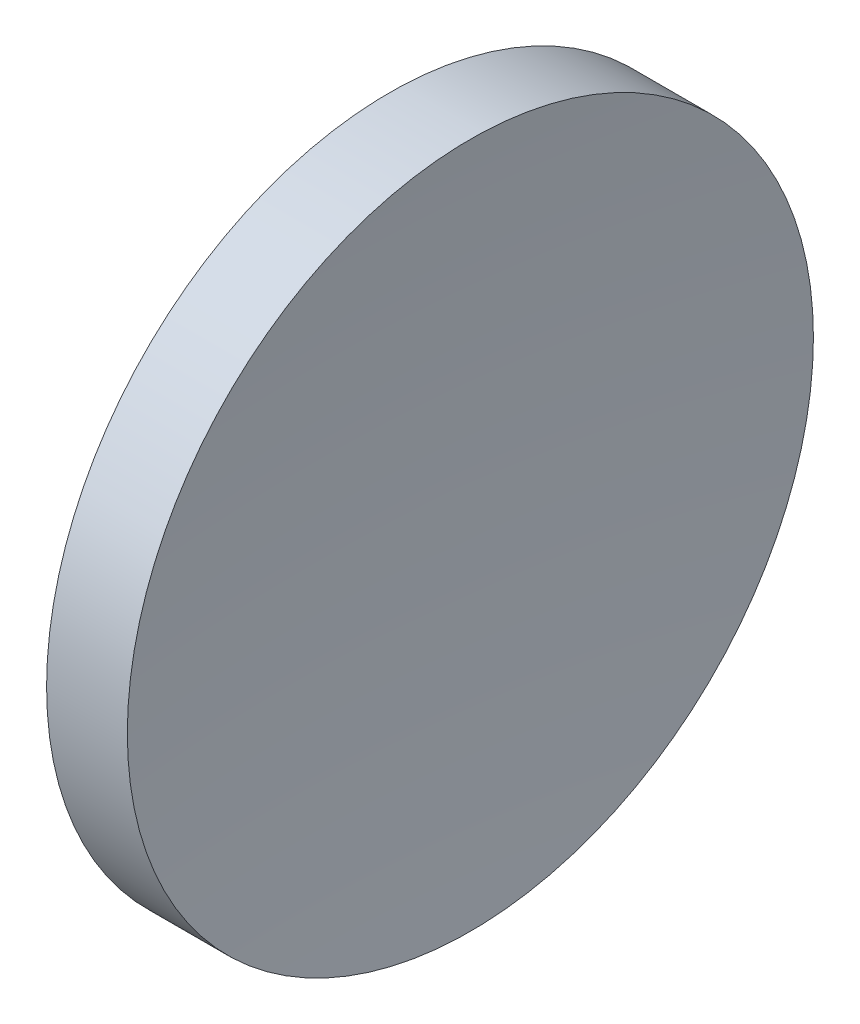
ISO-10303-21;
HEADER;
FILE_DESCRIPTION(('STEP AP214'),'2;1');
FILE_NAME('part.step','',(''),(''),'','','');
FILE_SCHEMA(('AUTOMOTIVE_DESIGN { 1 0 10303 214 1 1 1 1 }'));
ENDSEC;
DATA;
#1=APPLICATION_CONTEXT('core data for automotive mechanical design processes');
#2=APPLICATION_PROTOCOL_DEFINITION('international standard','automotive_design',2000,#1);
#3=PRODUCT_CONTEXT('',#1,'mechanical');
#4=PRODUCT('Part','Part','',(#3));
#5=PRODUCT_RELATED_PRODUCT_CATEGORY('part','',(#4));
#6=PRODUCT_DEFINITION_FORMATION('','',#4);
#7=PRODUCT_DEFINITION_CONTEXT('part definition',#1,'design');
#8=PRODUCT_DEFINITION('design','',#6,#7);
#9=PRODUCT_DEFINITION_SHAPE('','',#8);
#10=(LENGTH_UNIT() NAMED_UNIT(*) SI_UNIT(.MILLI.,.METRE.));
#11=(NAMED_UNIT(*) PLANE_ANGLE_UNIT() SI_UNIT($,.RADIAN.));
#12=(NAMED_UNIT(*) SI_UNIT($,.STERADIAN.) SOLID_ANGLE_UNIT());
#13=UNCERTAINTY_MEASURE_WITH_UNIT(LENGTH_MEASURE(1.E-05),#10,'distance_accuracy_value','');
#14=(GEOMETRIC_REPRESENTATION_CONTEXT(3) GLOBAL_UNCERTAINTY_ASSIGNED_CONTEXT((#13)) GLOBAL_UNIT_ASSIGNED_CONTEXT((#10,
#11,#12)) REPRESENTATION_CONTEXT('',''));
#15=CARTESIAN_POINT('',(0.,0.,0.));
#16=DIRECTION('',(0.,0.,1.));
#17=DIRECTION('',(1.,0.,0.));
#18=AXIS2_PLACEMENT_3D('',#15,#16,#17);
#19=CARTESIAN_POINT('',(128.439134688105,26.089041149195,0.0545449732430418));
#20=DIRECTION('',(0.,-1.,0.));
#21=DIRECTION('',(0.,0.,1.));
#22=AXIS2_PLACEMENT_3D('',#19,#20,#21);
#23=CIRCLE('',#22,82.62);
#24=TRIMMED_CURVE('',#23,(PARAMETER_VALUE(-1.57145651775599)),
(PARAMETER_VALUE(1.57145651775599)),.T.,.PARAMETER.);
#25=CARTESIAN_POINT('',(128.439134688105,26.089041149195,0.));
#26=DIRECTION('',(-1.,0.,0.));
#27=AXIS1_PLACEMENT('',#25,#26);
#28=SURFACE_OF_REVOLUTION('',#24,#27);
#29=CARTESIAN_POINT('',(46.2020740377033,26.089041149195,0.));
#30=DIRECTION('',(-1.,0.,0.));
#31=DIRECTION('',(0.,0.,1.));
#32=AXIS2_PLACEMENT_3D('',#29,#30,#31);
#33=CIRCLE('',#32,8.);
#34=CARTESIAN_POINT('',(46.2020740377033,26.089041149195,8.));
#35=VERTEX_POINT('',#34);
#36=EDGE_CURVE('E11',#35,#35,#33,.T.);
#37=ORIENTED_EDGE('',*,*,#36,.F.);
#38=EDGE_LOOP('',(#37));
#39=FACE_BOUND('',#38,.T.);
#40=CARTESIAN_POINT('',(45.8191526931544,26.089041149195,0.));
#41=VERTEX_POINT('',#40);
#42=VERTEX_LOOP('',#41);
#43=FACE_BOUND('',#42,.T.);
#44=ADVANCED_FACE('F37',(#39,#43),#28,.F.);
#45=CARTESIAN_POINT('',(42.4498611141368,26.089041149195,0.));
#46=DIRECTION('',(-1.,0.,0.));
#47=DIRECTION('',(0.,0.,1.));
#48=AXIS2_PLACEMENT_3D('',#45,#46,#47);
#49=CYLINDRICAL_SURFACE('',#48,8.);
#50=CARTESIAN_POINT('',(44.3191526931544,26.089041149195,0.));
#51=DIRECTION('',(-1.,0.,0.));
#52=DIRECTION('',(0.,0.,1.));
#53=AXIS2_PLACEMENT_3D('',#50,#51,#52);
#54=CIRCLE('',#53,8.);
#55=CARTESIAN_POINT('',(44.3191526931544,26.089041149195,8.));
#56=VERTEX_POINT('',#55);
#57=EDGE_CURVE('E43',#56,#56,#54,.T.);
#58=ORIENTED_EDGE('',*,*,#57,.F.);
#59=EDGE_LOOP('',(#58));
#60=FACE_BOUND('',#59,.T.);
#61=ORIENTED_EDGE('',*,*,#36,.T.);
#62=EDGE_LOOP('',(#61));
#63=FACE_BOUND('',#62,.T.);
#64=ADVANCED_FACE('F47',(#60,#63),#49,.T.);
#65=CARTESIAN_POINT('',(44.3191526931544,26.089041149195,0.));
#66=DIRECTION('',(1.,0.,0.));
#67=DIRECTION('',(0.,0.,-1.));
#68=AXIS2_PLACEMENT_3D('',#65,#66,#67);
#69=PLANE('',#68);
#70=ORIENTED_EDGE('',*,*,#57,.T.);
#71=EDGE_LOOP('',(#70));
#72=FACE_BOUND('',#71,.T.);
#73=ADVANCED_FACE('F52',(#72),#69,.F.);
#74=CLOSED_SHELL('',(#44,#64,#73));
#75=MANIFOLD_SOLID_BREP('B2',#74);
#76=ADVANCED_BREP_SHAPE_REPRESENTATION('',(#18,#75),#14);
#77=SHAPE_DEFINITION_REPRESENTATION(#9,#76);
ENDSEC;
END-ISO-10303-21;
